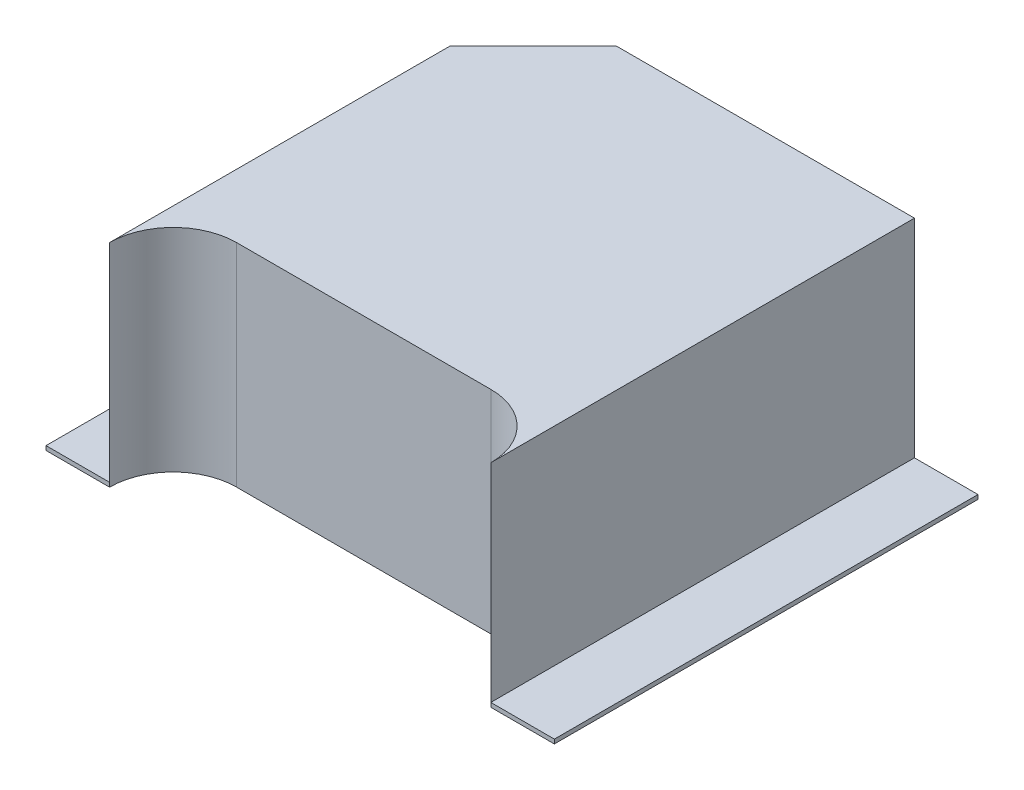
ISO-10303-21;
HEADER;
FILE_DESCRIPTION(('STEP AP214'),'2;1');
FILE_NAME('part.step','',(''),(''),'','','');
FILE_SCHEMA(('AUTOMOTIVE_DESIGN { 1 0 10303 214 1 1 1 1 }'));
ENDSEC;
DATA;
#1=APPLICATION_CONTEXT('core data for automotive mechanical design processes');
#2=APPLICATION_PROTOCOL_DEFINITION('international standard','automotive_design',2000,#1);
#3=PRODUCT_CONTEXT('',#1,'mechanical');
#4=PRODUCT('Part','Part','',(#3));
#5=PRODUCT_RELATED_PRODUCT_CATEGORY('part','',(#4));
#6=PRODUCT_DEFINITION_FORMATION('','',#4);
#7=PRODUCT_DEFINITION_CONTEXT('part definition',#1,'design');
#8=PRODUCT_DEFINITION('design','',#6,#7);
#9=PRODUCT_DEFINITION_SHAPE('','',#8);
#10=(LENGTH_UNIT() NAMED_UNIT(*) SI_UNIT(.MILLI.,.METRE.));
#11=(NAMED_UNIT(*) PLANE_ANGLE_UNIT() SI_UNIT($,.RADIAN.));
#12=(NAMED_UNIT(*) SI_UNIT($,.STERADIAN.) SOLID_ANGLE_UNIT());
#13=UNCERTAINTY_MEASURE_WITH_UNIT(LENGTH_MEASURE(1.E-05),#10,'distance_accuracy_value','');
#14=(GEOMETRIC_REPRESENTATION_CONTEXT(3) GLOBAL_UNCERTAINTY_ASSIGNED_CONTEXT((#13)) GLOBAL_UNIT_ASSIGNED_CONTEXT((#10,
#11,#12)) REPRESENTATION_CONTEXT('',''));
#15=CARTESIAN_POINT('',(0.,0.,0.));
#16=DIRECTION('',(0.,0.,1.));
#17=DIRECTION('',(1.,0.,0.));
#18=AXIS2_PLACEMENT_3D('',#15,#16,#17);
#19=CARTESIAN_POINT('',(0.,0.01,0.));
#20=DIRECTION('',(0.,1.,0.));
#21=DIRECTION('',(0.,0.,1.));
#22=AXIS2_PLACEMENT_3D('',#19,#20,#21);
#23=PLANE('',#22);
#24=DIRECTION('',(-1.,0.,0.));
#25=VECTOR('',#24,1.);
#26=CARTESIAN_POINT('',(-0.67,0.01,1.6));
#27=LINE('',#26,#25);
#28=CARTESIAN_POINT('',(-0.82,0.01,1.6));
#29=VERTEX_POINT('',#28);
#30=CARTESIAN_POINT('',(-0.67,0.01,1.6));
#31=VERTEX_POINT('',#30);
#32=EDGE_CURVE('E195',#29,#31,#27,.F.);
#33=ORIENTED_EDGE('',*,*,#32,.T.);
#34=DIRECTION('',(0.,0.,1.));
#35=VECTOR('',#34,1.);
#36=CARTESIAN_POINT('',(-0.67,0.01,0.6));
#37=LINE('',#36,#35);
#38=CARTESIAN_POINT('',(-0.67,0.01,0.6));
#39=VERTEX_POINT('',#38);
#40=EDGE_CURVE('E190',#31,#39,#37,.F.);
#41=ORIENTED_EDGE('',*,*,#40,.T.);
#42=DIRECTION('',(1.,0.,0.));
#43=VECTOR('',#42,1.);
#44=CARTESIAN_POINT('',(-1.523743748588,0.01,0.6));
#45=LINE('',#44,#43);
#46=CARTESIAN_POINT('',(-0.82,0.01,0.6));
#47=VERTEX_POINT('',#46);
#48=EDGE_CURVE('E179',#39,#47,#45,.F.);
#49=ORIENTED_EDGE('',*,*,#48,.T.);
#50=DIRECTION('',(0.,0.,1.));
#51=VECTOR('',#50,1.);
#52=CARTESIAN_POINT('',(-0.82,0.01,-1.6));
#53=LINE('',#52,#51);
#54=EDGE_CURVE('E169',#47,#29,#53,.T.);
#55=ORIENTED_EDGE('',*,*,#54,.T.);
#56=EDGE_LOOP('',(#33,#41,#49,#55));
#57=FACE_BOUND('',#56,.T.);
#58=ADVANCED_FACE('F17',(#57),#23,.T.);
#59=CARTESIAN_POINT('',(-0.82,-3.203513695928,-1.6));
#60=DIRECTION('',(-1.,0.,0.));
#61=DIRECTION('',(0.,0.,1.));
#62=AXIS2_PLACEMENT_3D('',#59,#60,#61);
#63=PLANE('',#62);
#64=DIRECTION('',(0.,1.,0.));
#65=VECTOR('',#64,1.);
#66=CARTESIAN_POINT('',(-0.82,-1.562049935181,1.6));
#67=LINE('',#66,#65);
#68=CARTESIAN_POINT('',(-0.82,0.5,1.6));
#69=VERTEX_POINT('',#68);
#70=EDGE_CURVE('E128',#69,#29,#67,.F.);
#71=ORIENTED_EDGE('',*,*,#70,.T.);
#72=ORIENTED_EDGE('',*,*,#54,.F.);
#73=DIRECTION('',(0.,1.,0.));
#74=VECTOR('',#73,1.);
#75=CARTESIAN_POINT('',(-0.82,-1.562049935181,0.6));
#76=LINE('',#75,#74);
#77=CARTESIAN_POINT('',(-0.82,0.5,0.6));
#78=VERTEX_POINT('',#77);
#79=EDGE_CURVE('E174',#47,#78,#76,.T.);
#80=ORIENTED_EDGE('',*,*,#79,.T.);
#81=DIRECTION('',(0.,0.,-1.));
#82=VECTOR('',#81,1.);
#83=CARTESIAN_POINT('',(-0.82,0.5,1.6));
#84=LINE('',#83,#82);
#85=EDGE_CURVE('E161',#78,#69,#84,.F.);
#86=ORIENTED_EDGE('',*,*,#85,.T.);
#87=EDGE_LOOP('',(#71,#72,#80,#86));
#88=FACE_BOUND('',#87,.T.);
#89=ADVANCED_FACE('F284',(#88),#63,.F.);
#90=CARTESIAN_POINT('',(-1.57,0.5,1.6));
#91=DIRECTION('',(0.,-1.,0.));
#92=DIRECTION('',(0.,0.,-1.));
#93=AXIS2_PLACEMENT_3D('',#90,#91,#92);
#94=PLANE('',#93);
#95=DIRECTION('',(0.,0.,-1.));
#96=VECTOR('',#95,1.);
#97=CARTESIAN_POINT('',(-1.72,0.5,-1.6));
#98=LINE('',#97,#96);
#99=CARTESIAN_POINT('',(-1.72,0.500000000000001,0.796256251412));
#100=VERTEX_POINT('',#99);
#101=CARTESIAN_POINT('',(-1.72,0.5,1.6));
#102=VERTEX_POINT('',#101);
#103=EDGE_CURVE('E103',#100,#102,#98,.F.);
#104=ORIENTED_EDGE('',*,*,#103,.T.);
#105=CARTESIAN_POINT('',(-1.57,0.5,1.6));
#106=DIRECTION('',(0.,1.,0.));
#107=DIRECTION('',(0.,0.,1.));
#108=AXIS2_PLACEMENT_3D('',#105,#106,#107);
#109=CIRCLE('',#108,0.15);
#110=CARTESIAN_POINT('',(-1.57,0.5,1.45));
#111=VERTEX_POINT('',#110);
#112=EDGE_CURVE('E20',#102,#111,#109,.F.);
#113=ORIENTED_EDGE('',*,*,#112,.T.);
#114=DIRECTION('',(-1.,0.,0.));
#115=VECTOR('',#114,1.);
#116=CARTESIAN_POINT('',(-0.97,0.5,1.45));
#117=LINE('',#116,#115);
#118=CARTESIAN_POINT('',(-0.97,0.5,1.45));
#119=VERTEX_POINT('',#118);
#120=EDGE_CURVE('E109',#111,#119,#117,.F.);
#121=ORIENTED_EDGE('',*,*,#120,.T.);
#122=CARTESIAN_POINT('',(-0.97,0.5,1.6));
#123=DIRECTION('',(0.,1.,0.));
#124=DIRECTION('',(0.,0.,1.));
#125=AXIS2_PLACEMENT_3D('',#122,#123,#124);
#126=CIRCLE('',#125,0.15);
#127=EDGE_CURVE('E126',#119,#69,#126,.F.);
#128=ORIENTED_EDGE('',*,*,#127,.T.);
#129=ORIENTED_EDGE('',*,*,#85,.F.);
#130=DIRECTION('',(1.,0.,0.));
#131=VECTOR('',#130,1.);
#132=CARTESIAN_POINT('',(-1.523743748588,0.5,0.6));
#133=LINE('',#132,#131);
#134=CARTESIAN_POINT('',(-1.523743748588,0.500000000000001,0.6));
#135=VERTEX_POINT('',#134);
#136=EDGE_CURVE('E172',#78,#135,#133,.F.);
#137=ORIENTED_EDGE('',*,*,#136,.T.);
#138=DIRECTION('',(0.707106781186548,0.,-0.707106781186548));
#139=VECTOR('',#138,1.);
#140=CARTESIAN_POINT('',(-1.87,0.500000000000001,0.946256251412));
#141=LINE('',#140,#139);
#142=EDGE_CURVE('E157',#135,#100,#141,.F.);
#143=ORIENTED_EDGE('',*,*,#142,.T.);
#144=EDGE_LOOP('',(#104,#113,#121,#128,#129,#137,#143));
#145=FACE_BOUND('',#144,.T.);
#146=ADVANCED_FACE('F118',(#145),#94,.F.);
#147=CARTESIAN_POINT('',(-1.72,-3.203513695928,-1.6));
#148=DIRECTION('',(1.,0.,0.));
#149=DIRECTION('',(0.,0.,-1.));
#150=AXIS2_PLACEMENT_3D('',#147,#148,#149);
#151=PLANE('',#150);
#152=DIRECTION('',(0.,1.,0.));
#153=VECTOR('',#152,1.);
#154=CARTESIAN_POINT('',(-1.72,-1.562049935181,1.6));
#155=LINE('',#154,#153);
#156=CARTESIAN_POINT('',(-1.72,0.01,1.6));
#157=VERTEX_POINT('',#156);
#158=EDGE_CURVE('E121',#157,#102,#155,.T.);
#159=ORIENTED_EDGE('',*,*,#158,.T.);
#160=ORIENTED_EDGE('',*,*,#103,.F.);
#161=DIRECTION('',(0.,1.,0.));
#162=VECTOR('',#161,1.);
#163=CARTESIAN_POINT('',(-1.72,-1.562049935181,0.796256251412));
#164=LINE('',#163,#162);
#165=CARTESIAN_POINT('',(-1.72,0.0100000000000007,0.796256251412));
#166=VERTEX_POINT('',#165);
#167=EDGE_CURVE('E152',#100,#166,#164,.F.);
#168=ORIENTED_EDGE('',*,*,#167,.T.);
#169=DIRECTION('',(0.,0.,1.));
#170=VECTOR('',#169,1.);
#171=CARTESIAN_POINT('',(-1.72,0.01,0.));
#172=LINE('',#171,#170);
#173=EDGE_CURVE('E144',#157,#166,#172,.F.);
#174=ORIENTED_EDGE('',*,*,#173,.F.);
#175=EDGE_LOOP('',(#159,#160,#168,#174));
#176=FACE_BOUND('',#175,.T.);
#177=ADVANCED_FACE('F292',(#176),#151,.F.);
#178=CARTESIAN_POINT('',(0.,0.01,0.));
#179=DIRECTION('',(0.,1.,0.));
#180=DIRECTION('',(0.,0.,1.));
#181=AXIS2_PLACEMENT_3D('',#178,#179,#180);
#182=PLANE('',#181);
#183=DIRECTION('',(-1.,0.,0.));
#184=VECTOR('',#183,1.);
#185=CARTESIAN_POINT('',(-1.72,0.01,1.6));
#186=LINE('',#185,#184);
#187=CARTESIAN_POINT('',(-1.87,0.01,1.6));
#188=VERTEX_POINT('',#187);
#189=EDGE_CURVE('E138',#188,#157,#186,.F.);
#190=ORIENTED_EDGE('',*,*,#189,.T.);
#191=ORIENTED_EDGE('',*,*,#173,.T.);
#192=DIRECTION('',(0.707106781186548,0.,-0.707106781186548));
#193=VECTOR('',#192,1.);
#194=CARTESIAN_POINT('',(-1.87,0.0100000000000009,0.946256251412));
#195=LINE('',#194,#193);
#196=CARTESIAN_POINT('',(-1.87,0.0100000000000003,0.946256251412));
#197=VERTEX_POINT('',#196);
#198=EDGE_CURVE('E150',#166,#197,#195,.F.);
#199=ORIENTED_EDGE('',*,*,#198,.T.);
#200=DIRECTION('',(0.,0.,-1.));
#201=VECTOR('',#200,1.);
#202=CARTESIAN_POINT('',(-1.87,0.01,1.6));
#203=LINE('',#202,#201);
#204=EDGE_CURVE('E132',#197,#188,#203,.F.);
#205=ORIENTED_EDGE('',*,*,#204,.T.);
#206=EDGE_LOOP('',(#190,#191,#199,#205));
#207=FACE_BOUND('',#206,.T.);
#208=ADVANCED_FACE('F299',(#207),#182,.T.);
#209=CARTESIAN_POINT('',(-1.57,-1.562049935181,1.6));
#210=DIRECTION('',(0.,1.,0.));
#211=DIRECTION('',(0.,0.,1.));
#212=AXIS2_PLACEMENT_3D('',#209,#210,#211);
#213=CYLINDRICAL_SURFACE('',#212,0.15);
#214=CARTESIAN_POINT('',(-1.57,0.,1.6));
#215=DIRECTION('',(0.,1.,0.));
#216=DIRECTION('',(0.,0.,1.));
#217=AXIS2_PLACEMENT_3D('',#214,#215,#216);
#218=CIRCLE('',#217,0.15);
#219=CARTESIAN_POINT('',(-1.72,0.,1.6));
#220=VERTEX_POINT('',#219);
#221=CARTESIAN_POINT('',(-1.57,0.,1.45));
#222=VERTEX_POINT('',#221);
#223=EDGE_CURVE('E125',#220,#222,#218,.F.);
#224=ORIENTED_EDGE('',*,*,#223,.T.);
#225=DIRECTION('',(0.,1.,0.));
#226=VECTOR('',#225,1.);
#227=CARTESIAN_POINT('',(-1.57,-1.562049935181,1.45));
#228=LINE('',#227,#226);
#229=EDGE_CURVE('E113',#222,#111,#228,.T.);
#230=ORIENTED_EDGE('',*,*,#229,.T.);
#231=ORIENTED_EDGE('',*,*,#112,.F.);
#232=ORIENTED_EDGE('',*,*,#158,.F.);
#233=DIRECTION('',(0.,1.,0.));
#234=VECTOR('',#233,1.);
#235=CARTESIAN_POINT('',(-1.72,-1.562049935181,1.6));
#236=LINE('',#235,#234);
#237=EDGE_CURVE('E134',#157,#220,#236,.F.);
#238=ORIENTED_EDGE('',*,*,#237,.T.);
#239=EDGE_LOOP('',(#224,#230,#231,#232,#238));
#240=FACE_BOUND('',#239,.T.);
#241=ADVANCED_FACE('F123',(#240),#213,.F.);
#242=CARTESIAN_POINT('',(-0.97,-1.562049935181,1.45));
#243=DIRECTION('',(0.,0.,-1.));
#244=DIRECTION('',(-1.,0.,0.));
#245=AXIS2_PLACEMENT_3D('',#242,#243,#244);
#246=PLANE('',#245);
#247=DIRECTION('',(1.,0.,0.));
#248=VECTOR('',#247,1.);
#249=CARTESIAN_POINT('',(0.,0.,1.45));
#250=LINE('',#249,#248);
#251=CARTESIAN_POINT('',(-0.97,0.,1.45));
#252=VERTEX_POINT('',#251);
#253=EDGE_CURVE('E208',#222,#252,#250,.T.);
#254=ORIENTED_EDGE('',*,*,#253,.T.);
#255=DIRECTION('',(0.,1.,0.));
#256=VECTOR('',#255,1.);
#257=CARTESIAN_POINT('',(-0.97,-1.562049935181,1.45));
#258=LINE('',#257,#256);
#259=EDGE_CURVE('E115',#252,#119,#258,.T.);
#260=ORIENTED_EDGE('',*,*,#259,.T.);
#261=ORIENTED_EDGE('',*,*,#120,.F.);
#262=ORIENTED_EDGE('',*,*,#229,.F.);
#263=EDGE_LOOP('',(#254,#260,#261,#262));
#264=FACE_BOUND('',#263,.T.);
#265=ADVANCED_FACE('F111',(#264),#246,.F.);
#266=CARTESIAN_POINT('',(-0.97,-1.562049935181,1.6));
#267=DIRECTION('',(0.,1.,0.));
#268=DIRECTION('',(0.,0.,1.));
#269=AXIS2_PLACEMENT_3D('',#266,#267,#268);
#270=CYLINDRICAL_SURFACE('',#269,0.15);
#271=CARTESIAN_POINT('',(-0.97,0.,1.6));
#272=DIRECTION('',(0.,1.,0.));
#273=DIRECTION('',(0.,0.,1.));
#274=AXIS2_PLACEMENT_3D('',#271,#272,#273);
#275=CIRCLE('',#274,0.15);
#276=CARTESIAN_POINT('',(-0.82,0.,1.6));
#277=VERTEX_POINT('',#276);
#278=EDGE_CURVE('E204',#252,#277,#275,.F.);
#279=ORIENTED_EDGE('',*,*,#278,.T.);
#280=DIRECTION('',(0.,1.,0.));
#281=VECTOR('',#280,1.);
#282=CARTESIAN_POINT('',(-0.82,-1.562049935181,1.6));
#283=LINE('',#282,#281);
#284=EDGE_CURVE('E197',#277,#29,#283,.T.);
#285=ORIENTED_EDGE('',*,*,#284,.T.);
#286=ORIENTED_EDGE('',*,*,#70,.F.);
#287=ORIENTED_EDGE('',*,*,#127,.F.);
#288=ORIENTED_EDGE('',*,*,#259,.F.);
#289=EDGE_LOOP('',(#279,#285,#286,#287,#288));
#290=FACE_BOUND('',#289,.T.);
#291=ADVANCED_FACE('F259',(#290),#270,.F.);
#292=CARTESIAN_POINT('',(-0.67,-1.562049935181,1.6));
#293=DIRECTION('',(0.,0.,-1.));
#294=DIRECTION('',(-1.,0.,0.));
#295=AXIS2_PLACEMENT_3D('',#292,#293,#294);
#296=PLANE('',#295);
#297=ORIENTED_EDGE('',*,*,#284,.F.);
#298=DIRECTION('',(1.,0.,0.));
#299=VECTOR('',#298,1.);
#300=CARTESIAN_POINT('',(0.,0.,1.6));
#301=LINE('',#300,#299);
#302=CARTESIAN_POINT('',(-0.67,0.,1.6));
#303=VERTEX_POINT('',#302);
#304=EDGE_CURVE('E207',#277,#303,#301,.T.);
#305=ORIENTED_EDGE('',*,*,#304,.T.);
#306=DIRECTION('',(0.,1.,0.));
#307=VECTOR('',#306,1.);
#308=CARTESIAN_POINT('',(-0.67,-1.562049935181,1.6));
#309=LINE('',#308,#307);
#310=EDGE_CURVE('E192',#303,#31,#309,.T.);
#311=ORIENTED_EDGE('',*,*,#310,.T.);
#312=ORIENTED_EDGE('',*,*,#32,.F.);
#313=EDGE_LOOP('',(#297,#305,#311,#312));
#314=FACE_BOUND('',#313,.T.);
#315=ADVANCED_FACE('F265',(#314),#296,.F.);
#316=CARTESIAN_POINT('',(-0.67,-1.562049935181,0.6));
#317=DIRECTION('',(-1.,0.,0.));
#318=DIRECTION('',(0.,0.,1.));
#319=AXIS2_PLACEMENT_3D('',#316,#317,#318);
#320=PLANE('',#319);
#321=ORIENTED_EDGE('',*,*,#310,.F.);
#322=DIRECTION('',(0.,0.,1.));
#323=VECTOR('',#322,1.);
#324=CARTESIAN_POINT('',(-0.67,0.,0.));
#325=LINE('',#324,#323);
#326=CARTESIAN_POINT('',(-0.67,0.,0.6));
#327=VERTEX_POINT('',#326);
#328=EDGE_CURVE('E240',#303,#327,#325,.F.);
#329=ORIENTED_EDGE('',*,*,#328,.T.);
#330=DIRECTION('',(0.,1.,0.));
#331=VECTOR('',#330,1.);
#332=CARTESIAN_POINT('',(-0.67,-1.562049935181,0.6));
#333=LINE('',#332,#331);
#334=EDGE_CURVE('E187',#327,#39,#333,.T.);
#335=ORIENTED_EDGE('',*,*,#334,.T.);
#336=ORIENTED_EDGE('',*,*,#40,.F.);
#337=EDGE_LOOP('',(#321,#329,#335,#336));
#338=FACE_BOUND('',#337,.T.);
#339=ADVANCED_FACE('F275',(#338),#320,.F.);
#340=CARTESIAN_POINT('',(-1.523743748588,-1.562049935181,0.6));
#341=DIRECTION('',(0.,0.,1.));
#342=DIRECTION('',(1.,0.,0.));
#343=AXIS2_PLACEMENT_3D('',#340,#341,#342);
#344=PLANE('',#343);
#345=ORIENTED_EDGE('',*,*,#79,.F.);
#346=ORIENTED_EDGE('',*,*,#48,.F.);
#347=ORIENTED_EDGE('',*,*,#334,.F.);
#348=DIRECTION('',(1.,0.,0.));
#349=VECTOR('',#348,1.);
#350=CARTESIAN_POINT('',(0.,0.,0.6));
#351=LINE('',#350,#349);
#352=CARTESIAN_POINT('',(-1.523743748588,0.,0.6));
#353=VERTEX_POINT('',#352);
#354=EDGE_CURVE('E231',#327,#353,#351,.F.);
#355=ORIENTED_EDGE('',*,*,#354,.T.);
#356=DIRECTION('',(0.,1.,0.));
#357=VECTOR('',#356,1.);
#358=CARTESIAN_POINT('',(-1.523743748588,-1.562049935181,0.6));
#359=LINE('',#358,#357);
#360=EDGE_CURVE('E165',#353,#135,#359,.T.);
#361=ORIENTED_EDGE('',*,*,#360,.T.);
#362=ORIENTED_EDGE('',*,*,#136,.F.);
#363=EDGE_LOOP('',(#345,#346,#347,#355,#361,#362));
#364=FACE_BOUND('',#363,.T.);
#365=ADVANCED_FACE('F281',(#364),#344,.F.);
#366=CARTESIAN_POINT('',(-1.87,-1.562049935181,0.946256251412));
#367=DIRECTION('',(0.707106781186548,0.,0.707106781186548));
#368=DIRECTION('',(0.707106781186548,0.,-0.707106781186548));
#369=AXIS2_PLACEMENT_3D('',#366,#367,#368);
#370=PLANE('',#369);
#371=ORIENTED_EDGE('',*,*,#167,.F.);
#372=ORIENTED_EDGE('',*,*,#142,.F.);
#373=ORIENTED_EDGE('',*,*,#360,.F.);
#374=DIRECTION('',(-0.707106781186548,0.,0.707106781186548));
#375=VECTOR('',#374,1.);
#376=CARTESIAN_POINT('',(-1.523743748588,0.,0.6));
#377=LINE('',#376,#375);
#378=CARTESIAN_POINT('',(-1.87,0.,0.946256251412));
#379=VERTEX_POINT('',#378);
#380=EDGE_CURVE('E222',#353,#379,#377,.T.);
#381=ORIENTED_EDGE('',*,*,#380,.T.);
#382=DIRECTION('',(0.,1.,0.));
#383=VECTOR('',#382,1.);
#384=CARTESIAN_POINT('',(-1.87,-1.562049935181,0.946256251412));
#385=LINE('',#384,#383);
#386=EDGE_CURVE('E135',#379,#197,#385,.T.);
#387=ORIENTED_EDGE('',*,*,#386,.T.);
#388=ORIENTED_EDGE('',*,*,#198,.F.);
#389=EDGE_LOOP('',(#371,#372,#373,#381,#387,#388));
#390=FACE_BOUND('',#389,.T.);
#391=ADVANCED_FACE('F288',(#390),#370,.F.);
#392=CARTESIAN_POINT('',(-1.87,-1.562049935181,1.6));
#393=DIRECTION('',(1.,0.,0.));
#394=DIRECTION('',(0.,0.,-1.));
#395=AXIS2_PLACEMENT_3D('',#392,#393,#394);
#396=PLANE('',#395);
#397=ORIENTED_EDGE('',*,*,#386,.F.);
#398=DIRECTION('',(0.,0.,1.));
#399=VECTOR('',#398,1.);
#400=CARTESIAN_POINT('',(-1.87,0.,0.));
#401=LINE('',#400,#399);
#402=CARTESIAN_POINT('',(-1.87,0.,1.6));
#403=VERTEX_POINT('',#402);
#404=EDGE_CURVE('E26',#379,#403,#401,.T.);
#405=ORIENTED_EDGE('',*,*,#404,.T.);
#406=DIRECTION('',(0.,1.,0.));
#407=VECTOR('',#406,1.);
#408=CARTESIAN_POINT('',(-1.87,-1.562049935181,1.6));
#409=LINE('',#408,#407);
#410=EDGE_CURVE('E34',#403,#188,#409,.T.);
#411=ORIENTED_EDGE('',*,*,#410,.T.);
#412=ORIENTED_EDGE('',*,*,#204,.F.);
#413=EDGE_LOOP('',(#397,#405,#411,#412));
#414=FACE_BOUND('',#413,.T.);
#415=ADVANCED_FACE('F296',(#414),#396,.F.);
#416=CARTESIAN_POINT('',(-1.72,-1.562049935181,1.6));
#417=DIRECTION('',(0.,0.,-1.));
#418=DIRECTION('',(-1.,0.,0.));
#419=AXIS2_PLACEMENT_3D('',#416,#417,#418);
#420=PLANE('',#419);
#421=ORIENTED_EDGE('',*,*,#410,.F.);
#422=DIRECTION('',(1.,0.,0.));
#423=VECTOR('',#422,1.);
#424=CARTESIAN_POINT('',(0.,0.,1.6));
#425=LINE('',#424,#423);
#426=EDGE_CURVE('E11',#403,#220,#425,.T.);
#427=ORIENTED_EDGE('',*,*,#426,.T.);
#428=ORIENTED_EDGE('',*,*,#237,.F.);
#429=ORIENTED_EDGE('',*,*,#189,.F.);
#430=EDGE_LOOP('',(#421,#427,#428,#429));
#431=FACE_BOUND('',#430,.T.);
#432=ADVANCED_FACE('F294',(#431),#420,.F.);
#433=CARTESIAN_POINT('',(0.,0.,0.));
#434=DIRECTION('',(0.,1.,0.));
#435=DIRECTION('',(0.,0.,1.));
#436=AXIS2_PLACEMENT_3D('',#433,#434,#435);
#437=PLANE('',#436);
#438=ORIENTED_EDGE('',*,*,#404,.F.);
#439=ORIENTED_EDGE('',*,*,#380,.F.);
#440=ORIENTED_EDGE('',*,*,#354,.F.);
#441=ORIENTED_EDGE('',*,*,#328,.F.);
#442=ORIENTED_EDGE('',*,*,#304,.F.);
#443=ORIENTED_EDGE('',*,*,#278,.F.);
#444=ORIENTED_EDGE('',*,*,#253,.F.);
#445=ORIENTED_EDGE('',*,*,#223,.F.);
#446=ORIENTED_EDGE('',*,*,#426,.F.);
#447=EDGE_LOOP('',(#438,#439,#440,#441,#442,#443,#444,#445,#446));
#448=FACE_BOUND('',#447,.T.);
#449=ADVANCED_FACE('F269',(#448),#437,.F.);
#450=CLOSED_SHELL('',(#58,#89,#146,#177,#208,#241,#265,#291,#315,#339,#365,#391,#415,#432,#449));
#451=MANIFOLD_SOLID_BREP('B1',#450);
#452=ADVANCED_BREP_SHAPE_REPRESENTATION('',(#18,#451),#14);
#453=SHAPE_DEFINITION_REPRESENTATION(#9,#452);
ENDSEC;
END-ISO-10303-21;
